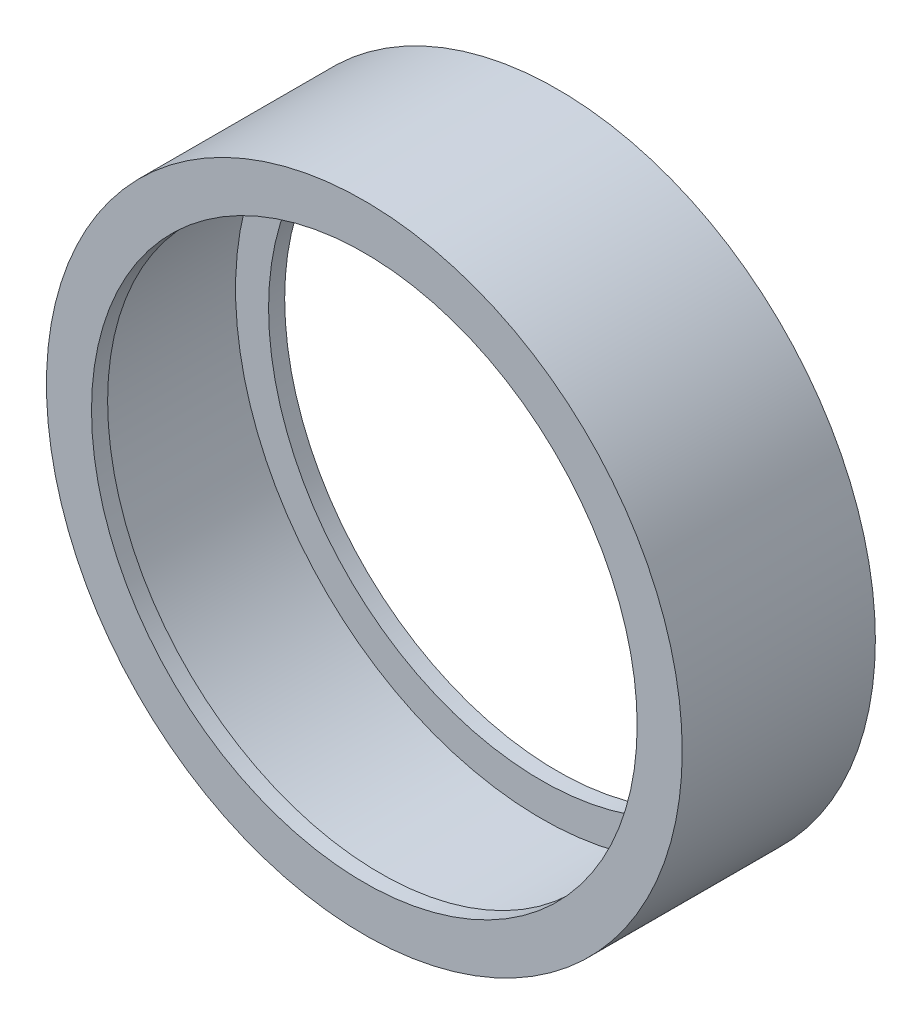
ISO-10303-21;
HEADER;
FILE_DESCRIPTION(('STEP AP214'),'2;1');
FILE_NAME('part.step','',(''),(''),'','','');
FILE_SCHEMA(('AUTOMOTIVE_DESIGN { 1 0 10303 214 1 1 1 1 }'));
ENDSEC;
DATA;
#1=APPLICATION_CONTEXT('core data for automotive mechanical design processes');
#2=APPLICATION_PROTOCOL_DEFINITION('international standard','automotive_design',2000,#1);
#3=PRODUCT_CONTEXT('',#1,'mechanical');
#4=PRODUCT('Part','Part','',(#3));
#5=PRODUCT_RELATED_PRODUCT_CATEGORY('part','',(#4));
#6=PRODUCT_DEFINITION_FORMATION('','',#4);
#7=PRODUCT_DEFINITION_CONTEXT('part definition',#1,'design');
#8=PRODUCT_DEFINITION('design','',#6,#7);
#9=PRODUCT_DEFINITION_SHAPE('','',#8);
#10=(LENGTH_UNIT() NAMED_UNIT(*) SI_UNIT(.MILLI.,.METRE.));
#11=(NAMED_UNIT(*) PLANE_ANGLE_UNIT() SI_UNIT($,.RADIAN.));
#12=(NAMED_UNIT(*) SI_UNIT($,.STERADIAN.) SOLID_ANGLE_UNIT());
#13=UNCERTAINTY_MEASURE_WITH_UNIT(LENGTH_MEASURE(1.E-05),#10,'distance_accuracy_value','');
#14=(GEOMETRIC_REPRESENTATION_CONTEXT(3) GLOBAL_UNCERTAINTY_ASSIGNED_CONTEXT((#13)) GLOBAL_UNIT_ASSIGNED_CONTEXT((#10,
#11,#12)) REPRESENTATION_CONTEXT('',''));
#15=CARTESIAN_POINT('',(0.,0.,0.));
#16=DIRECTION('',(0.,0.,1.));
#17=DIRECTION('',(1.,0.,0.));
#18=AXIS2_PLACEMENT_3D('',#15,#16,#17);
#19=CARTESIAN_POINT('',(0.,0.,-3.81));
#20=DIRECTION('',(0.,0.,1.));
#21=DIRECTION('',(1.,0.,0.));
#22=AXIS2_PLACEMENT_3D('',#19,#20,#21);
#23=CYLINDRICAL_SURFACE('',#22,5.0165);
#24=CARTESIAN_POINT('',(0.,0.,-1.016));
#25=DIRECTION('',(0.,0.,1.));
#26=DIRECTION('',(1.,0.,0.));
#27=AXIS2_PLACEMENT_3D('',#24,#25,#26);
#28=CIRCLE('',#27,5.0165);
#29=CARTESIAN_POINT('',(5.0165,0.,-1.016));
#30=VERTEX_POINT('',#29);
#31=EDGE_CURVE('E47',#30,#30,#28,.T.);
#32=ORIENTED_EDGE('',*,*,#31,.F.);
#33=EDGE_LOOP('',(#32));
#34=FACE_BOUND('',#33,.T.);
#35=CARTESIAN_POINT('',(0.,0.,-4.064));
#36=DIRECTION('',(0.,0.,-1.));
#37=DIRECTION('',(-1.,0.,0.));
#38=AXIS2_PLACEMENT_3D('',#35,#36,#37);
#39=CIRCLE('',#38,5.0165);
#40=CARTESIAN_POINT('',(-5.0165,0.,-4.064));
#41=VERTEX_POINT('',#40);
#42=EDGE_CURVE('E55',#41,#41,#39,.T.);
#43=ORIENTED_EDGE('',*,*,#42,.F.);
#44=EDGE_LOOP('',(#43));
#45=FACE_BOUND('',#44,.T.);
#46=ADVANCED_FACE('F37',(#34,#45),#23,.T.);
#47=CARTESIAN_POINT('',(0.,0.,-3.81));
#48=DIRECTION('',(0.,0.,1.));
#49=DIRECTION('',(1.,0.,0.));
#50=AXIS2_PLACEMENT_3D('',#47,#48,#49);
#51=CYLINDRICAL_SURFACE('',#50,4.826);
#52=CARTESIAN_POINT('',(0.,0.,-3.81));
#53=DIRECTION('',(0.,0.,1.));
#54=DIRECTION('',(1.,0.,0.));
#55=AXIS2_PLACEMENT_3D('',#52,#53,#54);
#56=CIRCLE('',#55,4.826);
#57=CARTESIAN_POINT('',(4.826,0.,-3.81));
#58=VERTEX_POINT('',#57);
#59=EDGE_CURVE('E10',#58,#58,#56,.T.);
#60=ORIENTED_EDGE('',*,*,#59,.F.);
#61=EDGE_LOOP('',(#60));
#62=FACE_BOUND('',#61,.T.);
#63=CARTESIAN_POINT('',(0.,0.,-1.27));
#64=DIRECTION('',(0.,0.,1.));
#65=DIRECTION('',(1.,0.,0.));
#66=AXIS2_PLACEMENT_3D('',#63,#64,#65);
#67=CIRCLE('',#66,4.826);
#68=CARTESIAN_POINT('',(4.826,0.,-1.27));
#69=VERTEX_POINT('',#68);
#70=EDGE_CURVE('E40',#69,#69,#67,.T.);
#71=ORIENTED_EDGE('',*,*,#70,.T.);
#72=EDGE_LOOP('',(#71));
#73=FACE_BOUND('',#72,.T.);
#74=ADVANCED_FACE('F84',(#62,#73),#51,.F.);
#75=CARTESIAN_POINT('',(0.,0.,-1.27));
#76=DIRECTION('',(0.,0.,1.));
#77=DIRECTION('',(1.,0.,0.));
#78=AXIS2_PLACEMENT_3D('',#75,#76,#77);
#79=PLANE('',#78);
#80=CARTESIAN_POINT('',(0.,0.,-1.27));
#81=DIRECTION('',(0.,0.,1.));
#82=DIRECTION('',(1.,0.,0.));
#83=AXIS2_PLACEMENT_3D('',#80,#81,#82);
#84=CIRCLE('',#83,4.3053);
#85=CARTESIAN_POINT('',(4.3053,0.,-1.27));
#86=VERTEX_POINT('',#85);
#87=EDGE_CURVE('E52',#86,#86,#84,.T.);
#88=ORIENTED_EDGE('',*,*,#87,.T.);
#89=EDGE_LOOP('',(#88));
#90=FACE_BOUND('',#89,.T.);
#91=ORIENTED_EDGE('',*,*,#70,.F.);
#92=EDGE_LOOP('',(#91));
#93=FACE_BOUND('',#92,.T.);
#94=ADVANCED_FACE('F89',(#90,#93),#79,.F.);
#95=CARTESIAN_POINT('',(0.,0.,-1.016));
#96=DIRECTION('',(0.,0.,1.));
#97=DIRECTION('',(1.,0.,0.));
#98=AXIS2_PLACEMENT_3D('',#95,#96,#97);
#99=PLANE('',#98);
#100=ORIENTED_EDGE('',*,*,#31,.T.);
#101=EDGE_LOOP('',(#100));
#102=FACE_BOUND('',#101,.T.);
#103=CARTESIAN_POINT('',(0.,0.,-1.016));
#104=DIRECTION('',(0.,0.,1.));
#105=DIRECTION('',(1.,0.,0.));
#106=AXIS2_PLACEMENT_3D('',#103,#104,#105);
#107=CIRCLE('',#106,4.3053);
#108=CARTESIAN_POINT('',(4.3053,0.,-1.016));
#109=VERTEX_POINT('',#108);
#110=EDGE_CURVE('E51',#109,#109,#107,.T.);
#111=ORIENTED_EDGE('',*,*,#110,.F.);
#112=EDGE_LOOP('',(#111));
#113=FACE_BOUND('',#112,.T.);
#114=ADVANCED_FACE('F95',(#102,#113),#99,.T.);
#115=CARTESIAN_POINT('',(0.,0.,-1.016));
#116=DIRECTION('',(0.,0.,-1.));
#117=DIRECTION('',(-1.,0.,0.));
#118=AXIS2_PLACEMENT_3D('',#115,#116,#117);
#119=CYLINDRICAL_SURFACE('',#118,4.3053);
#120=ORIENTED_EDGE('',*,*,#110,.T.);
#121=EDGE_LOOP('',(#120));
#122=FACE_BOUND('',#121,.T.);
#123=ORIENTED_EDGE('',*,*,#87,.F.);
#124=EDGE_LOOP('',(#123));
#125=FACE_BOUND('',#124,.T.);
#126=ADVANCED_FACE('F80',(#122,#125),#119,.F.);
#127=CARTESIAN_POINT('',(0.,0.,-3.81));
#128=DIRECTION('',(0.,0.,-1.));
#129=DIRECTION('',(-1.,0.,0.));
#130=AXIS2_PLACEMENT_3D('',#127,#128,#129);
#131=PLANE('',#130);
#132=CARTESIAN_POINT('',(0.,0.,-3.81));
#133=DIRECTION('',(0.,0.,-1.));
#134=DIRECTION('',(-1.,0.,0.));
#135=AXIS2_PLACEMENT_3D('',#132,#133,#134);
#136=CIRCLE('',#135,4.3053);
#137=CARTESIAN_POINT('',(-4.3053,0.,-3.81));
#138=VERTEX_POINT('',#137);
#139=EDGE_CURVE('E61',#138,#138,#136,.T.);
#140=ORIENTED_EDGE('',*,*,#139,.T.);
#141=EDGE_LOOP('',(#140));
#142=FACE_BOUND('',#141,.T.);
#143=ORIENTED_EDGE('',*,*,#59,.T.);
#144=EDGE_LOOP('',(#143));
#145=FACE_BOUND('',#144,.T.);
#146=ADVANCED_FACE('F72',(#142,#145),#131,.F.);
#147=CARTESIAN_POINT('',(0.,0.,-4.064));
#148=DIRECTION('',(0.,0.,-1.));
#149=DIRECTION('',(-1.,0.,0.));
#150=AXIS2_PLACEMENT_3D('',#147,#148,#149);
#151=PLANE('',#150);
#152=ORIENTED_EDGE('',*,*,#42,.T.);
#153=EDGE_LOOP('',(#152));
#154=FACE_BOUND('',#153,.T.);
#155=CARTESIAN_POINT('',(0.,0.,-4.064));
#156=DIRECTION('',(0.,0.,-1.));
#157=DIRECTION('',(-1.,0.,0.));
#158=AXIS2_PLACEMENT_3D('',#155,#156,#157);
#159=CIRCLE('',#158,4.3053);
#160=CARTESIAN_POINT('',(-4.3053,0.,-4.064));
#161=VERTEX_POINT('',#160);
#162=EDGE_CURVE('E60',#161,#161,#159,.T.);
#163=ORIENTED_EDGE('',*,*,#162,.F.);
#164=EDGE_LOOP('',(#163));
#165=FACE_BOUND('',#164,.T.);
#166=ADVANCED_FACE('F70',(#154,#165),#151,.T.);
#167=CARTESIAN_POINT('',(0.,0.,-4.064));
#168=DIRECTION('',(0.,0.,1.));
#169=DIRECTION('',(1.,0.,0.));
#170=AXIS2_PLACEMENT_3D('',#167,#168,#169);
#171=CYLINDRICAL_SURFACE('',#170,4.3053);
#172=ORIENTED_EDGE('',*,*,#162,.T.);
#173=EDGE_LOOP('',(#172));
#174=FACE_BOUND('',#173,.T.);
#175=ORIENTED_EDGE('',*,*,#139,.F.);
#176=EDGE_LOOP('',(#175));
#177=FACE_BOUND('',#176,.T.);
#178=ADVANCED_FACE('F67',(#174,#177),#171,.F.);
#179=CLOSED_SHELL('',(#46,#74,#94,#114,#126,#146,#166,#178));
#180=MANIFOLD_SOLID_BREP('B2',#179);
#181=ADVANCED_BREP_SHAPE_REPRESENTATION('',(#18,#180),#14);
#182=SHAPE_DEFINITION_REPRESENTATION(#9,#181);
ENDSEC;
END-ISO-10303-21;
